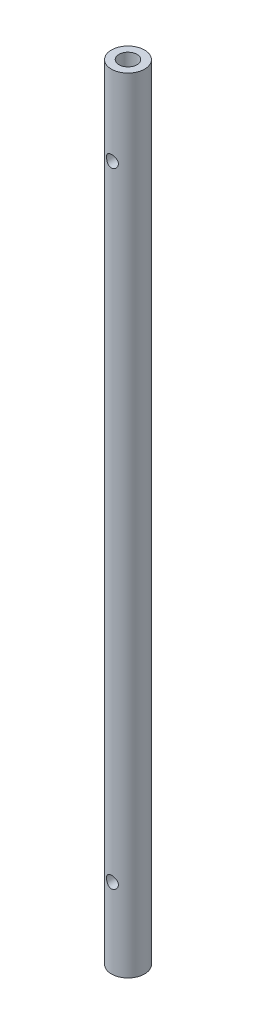
ISO-10303-21;
HEADER;
FILE_DESCRIPTION(('STEP AP214'),'2;1');
FILE_NAME('part.step','',(''),(''),'','','');
FILE_SCHEMA(('AUTOMOTIVE_DESIGN { 1 0 10303 214 1 1 1 1 }'));
ENDSEC;
DATA;
#1=APPLICATION_CONTEXT('core data for automotive mechanical design processes');
#2=APPLICATION_PROTOCOL_DEFINITION('international standard','automotive_design',2000,#1);
#3=PRODUCT_CONTEXT('',#1,'mechanical');
#4=PRODUCT('Part','Part','',(#3));
#5=PRODUCT_RELATED_PRODUCT_CATEGORY('part','',(#4));
#6=PRODUCT_DEFINITION_FORMATION('','',#4);
#7=PRODUCT_DEFINITION_CONTEXT('part definition',#1,'design');
#8=PRODUCT_DEFINITION('design','',#6,#7);
#9=PRODUCT_DEFINITION_SHAPE('','',#8);
#10=(LENGTH_UNIT() NAMED_UNIT(*) SI_UNIT(.MILLI.,.METRE.));
#11=(NAMED_UNIT(*) PLANE_ANGLE_UNIT() SI_UNIT($,.RADIAN.));
#12=(NAMED_UNIT(*) SI_UNIT($,.STERADIAN.) SOLID_ANGLE_UNIT());
#13=UNCERTAINTY_MEASURE_WITH_UNIT(LENGTH_MEASURE(1.E-05),#10,'distance_accuracy_value','');
#14=(GEOMETRIC_REPRESENTATION_CONTEXT(3) GLOBAL_UNCERTAINTY_ASSIGNED_CONTEXT((#13)) GLOBAL_UNIT_ASSIGNED_CONTEXT((#10,
#11,#12)) REPRESENTATION_CONTEXT('',''));
#15=CARTESIAN_POINT('',(0.,0.,0.));
#16=DIRECTION('',(0.,0.,1.));
#17=DIRECTION('',(1.,0.,0.));
#18=AXIS2_PLACEMENT_3D('',#15,#16,#17);
#19=CARTESIAN_POINT('',(0.,134.7724,0.));
#20=DIRECTION('',(0.,1.,0.));
#21=DIRECTION('',(0.,0.,1.));
#22=AXIS2_PLACEMENT_3D('',#19,#20,#21);
#23=CONICAL_SURFACE('',#22,1.7272,1.02974425867665);
#24=CARTESIAN_POINT('',(0.,134.7724,0.));
#25=DIRECTION('',(0.,1.,0.));
#26=DIRECTION('',(0.,0.,1.));
#27=AXIS2_PLACEMENT_3D('',#24,#25,#26);
#28=CIRCLE('',#27,1.7272);
#29=CARTESIAN_POINT('',(-1.11997871854781,134.7724,-1.31486406521738));
#30=VERTEX_POINT('',#29);
#31=CARTESIAN_POINT('',(-1.11997871854781,134.7724,1.31486406521738));
#32=VERTEX_POINT('',#31);
#33=EDGE_CURVE('E87',#30,#32,#28,.T.);
#34=ORIENTED_EDGE('',*,*,#33,.T.);
#35=CARTESIAN_POINT('',(-1.10083924997971,134.876380646118,1.54890731228398));
#36=CARTESIAN_POINT('',(-1.10511758447228,134.858012832155,1.50835814459138));
#37=CARTESIAN_POINT('',(-1.10888402191525,134.83975657298,1.46770662256737));
#38=CARTESIAN_POINT('',(-1.11544882432673,134.803549455213,1.38619229753739));
#39=CARTESIAN_POINT('',(-1.11824723760108,134.785598581425,1.34532950517744));
#40=CARTESIAN_POINT('',(-1.12528101838931,134.732275875879,1.22229557238897));
#41=CARTESIAN_POINT('',(-1.12814346307315,134.697484931141,1.13979036171758));
#42=CARTESIAN_POINT('',(-1.13079732619442,134.629117552434,0.970440108954381));
#43=CARTESIAN_POINT('',(-1.13046377449956,134.595642412668,0.88355184755493));
#44=CARTESIAN_POINT('',(-1.12817589359432,134.54898752196,0.752002666471074));
#45=CARTESIAN_POINT('',(-1.12711587079375,134.534032436263,0.70796225261359));
#46=CARTESIAN_POINT('',(-1.12459554649117,134.505697605106,0.619389773105011));
#47=CARTESIAN_POINT('',(-1.12313508899023,134.492318476508,0.574857522349348));
#48=CARTESIAN_POINT('',(-1.11777548337252,134.44941522858,0.419029107131832));
#49=CARTESIAN_POINT('',(-1.11345348376878,134.42514539767,0.306031376487295));
#50=CARTESIAN_POINT('',(-1.10979086221514,134.405546431952,0.13538961810765));
#51=CARTESIAN_POINT('',(-1.10903520058948,134.401779664163,0.0787717157606772));
#52=CARTESIAN_POINT('',(-1.10873081641357,134.400240594329,-0.0345470847061932));
#53=CARTESIAN_POINT('',(-1.10918191342738,134.40246739612,-0.0912479691515204));
#54=CARTESIAN_POINT('',(-1.11141205212762,134.414121408052,-0.221572406530796));
#55=CARTESIAN_POINT('',(-1.11355885742403,134.425563702272,-0.295002559258893));
#56=CARTESIAN_POINT('',(-1.11838407367354,134.455628431662,-0.440384970862432));
#57=CARTESIAN_POINT('',(-1.12106340494739,134.474263350518,-0.512334429843554));
#58=CARTESIAN_POINT('',(-1.12576435521266,134.516582974443,-0.656062520665535));
#59=CARTESIAN_POINT('',(-1.12777385681054,134.540349093944,-0.72781688608081));
#60=CARTESIAN_POINT('',(-1.13021183567748,134.590963420783,-0.870179154069858));
#61=CARTESIAN_POINT('',(-1.13064145382998,134.617809389612,-0.940787847270475));
#62=CARTESIAN_POINT('',(-1.1291823336618,134.682032091552,-1.10273118271327));
#63=CARTESIAN_POINT('',(-1.12654220488782,134.720113488266,-1.19378121217159));
#64=CARTESIAN_POINT('',(-1.11932742829999,134.778300988472,-1.32864327288224));
#65=CARTESIAN_POINT('',(-1.11642548696807,134.797672206229,-1.37287044412396));
#66=CARTESIAN_POINT('',(-1.10949476672364,134.836778540783,-1.46107381895178));
#67=CARTESIAN_POINT('',(-1.10546600777706,134.856513651125,-1.50505002697057));
#68=CARTESIAN_POINT('',(-1.10083924997971,134.876380646118,-1.54890731228398));
#69=B_SPLINE_CURVE_WITH_KNOTS('',3,(#35,#36,#37,#38,#39,#40,#41,#42,#43,#44,#45,#46,#47,#48,#49,
#50,#51,#52,#53,#54,#55,#56,#57,#58,#59,#60,#61,#62,#63,#64,#65,#66,#67,#68),.UNSPECIFIED.,.F.,
.F.,(4,2,2,2,2,2,2,2,2,2,2,2,2,2,2,2,4),(0.,0.134154521615997,0.268302347757204,
0.536967002414625,0.816178585226729,0.955708698776483,1.09529324704708,1.44052647667523,
1.61046744072474,1.78038299642616,2.00288343568417,2.22577180111875,2.45249743943343,
2.6790593198581,2.97510233572286,3.12020152788532,3.26529814921655),.UNSPECIFIED.);
#70=EDGE_CURVE('E55',#32,#30,#69,.T.);
#71=ORIENTED_EDGE('',*,*,#70,.T.);
#72=EDGE_LOOP('',(#34,#71));
#73=FACE_BOUND('',#72,.T.);
#74=ADVANCED_FACE('F36',(#73),#23,.F.);
#75=CARTESIAN_POINT('',(0.,149.86,0.));
#76=DIRECTION('',(0.,-1.,0.));
#77=DIRECTION('',(0.,0.,-1.));
#78=AXIS2_PLACEMENT_3D('',#75,#76,#77);
#79=CYLINDRICAL_SURFACE('',#78,3.175);
#80=CARTESIAN_POINT('',(0.,16.3703,-3.175));
#81=CARTESIAN_POINT('',(-0.0614285544766779,16.3703012237574,-3.17500087649076));
#82=CARTESIAN_POINT('',(-0.122848391480888,16.3652763210169,-3.17320130070144));
#83=CARTESIAN_POINT('',(-0.243864611742385,16.3453814145643,-3.1662010034201));
#84=CARTESIAN_POINT('',(-0.303461052111788,16.33051171954,-3.16100038856924));
#85=CARTESIAN_POINT('',(-0.419068309151049,16.2915115500278,-3.14775949893737));
#86=CARTESIAN_POINT('',(-0.47508540318598,16.2673978382583,-3.13972436624609));
#87=CARTESIAN_POINT('',(-0.58227804161651,16.2106749598776,-3.12162393487057));
#88=CARTESIAN_POINT('',(-0.633452431498656,16.1780637743668,-3.11155815385673));
#89=CARTESIAN_POINT('',(-0.731495005230033,16.1039449200735,-3.09000790855595));
#90=CARTESIAN_POINT('',(-0.7781496162439,16.0621656831014,-3.07848610582585));
#91=CARTESIAN_POINT('',(-0.863958107942661,15.9714734586916,-3.055516031792));
#92=CARTESIAN_POINT('',(-0.903110009958693,15.9225585953687,-3.04406778065305));
#93=CARTESIAN_POINT('',(-0.974093633832359,15.816974309823,-3.02211785986225));
#94=CARTESIAN_POINT('',(-1.00563502809097,15.7600994816667,-3.01166094904186));
#95=CARTESIAN_POINT('',(-1.0586113470591,15.6414206024001,-2.99345244738711));
#96=CARTESIAN_POINT('',(-1.0800498566148,15.5796183088365,-2.98569989720789));
#97=CARTESIAN_POINT('',(-1.11138819305283,15.4552850551509,-2.9741742173714));
#98=CARTESIAN_POINT('',(-1.12169236541681,15.3928693002161,-2.97026214805179));
#99=CARTESIAN_POINT('',(-1.13173392893205,15.2670815214047,-2.96645158379256));
#100=CARTESIAN_POINT('',(-1.13147514856467,15.2037098523184,-2.96655163468287));
#101=CARTESIAN_POINT('',(-1.12070953557278,15.0813866338982,-2.97063328242024));
#102=CARTESIAN_POINT('',(-1.11074743190182,15.0223790208862,-2.9744085523292));
#103=CARTESIAN_POINT('',(-1.08175290027525,14.9069353575906,-2.98507483987672));
#104=CARTESIAN_POINT('',(-1.06271924100948,14.8504996575404,-2.99196628047622));
#105=CARTESIAN_POINT('',(-1.01579639288465,14.740632376704,-3.00822311818093));
#106=CARTESIAN_POINT('',(-0.987756625641378,14.6872715264627,-3.01763009039321));
#107=CARTESIAN_POINT('',(-0.923722187948489,14.585847739274,-3.03784253722576));
#108=CARTESIAN_POINT('',(-0.887724971743384,14.5377865051773,-3.04864845893998));
#109=CARTESIAN_POINT('',(-0.806247147627669,14.4452887750887,-3.0712342285018));
#110=CARTESIAN_POINT('',(-0.760326653485443,14.4012436445668,-3.08303358094073));
#111=CARTESIAN_POINT('',(-0.661610098844969,14.321369593097,-3.10571393948941));
#112=CARTESIAN_POINT('',(-0.608813181467752,14.285541697647,-3.11659483086973));
#113=CARTESIAN_POINT('',(-0.496923650490421,14.2227435612336,-3.13639217173446));
#114=CARTESIAN_POINT('',(-0.437759573781159,14.1958916372621,-3.14528190725224));
#115=CARTESIAN_POINT('',(-0.315359989841962,14.1526479980796,-3.15989936928577));
#116=CARTESIAN_POINT('',(-0.252126116160289,14.1362521144617,-3.16562835574328));
#117=CARTESIAN_POINT('',(-0.126684885961715,14.1151105107097,-3.17306329879329));
#118=CARTESIAN_POINT('',(-0.064577181688216,14.1098369556619,-3.17495136824996));
#119=CARTESIAN_POINT('',(0.0596565359676973,14.1095683995767,-3.1750467253115));
#120=CARTESIAN_POINT('',(0.121782543364873,14.1145713815626,-3.1732547352019));
#121=CARTESIAN_POINT('',(0.242087689559502,14.1343044474424,-3.16631168752834));
#122=CARTESIAN_POINT('',(0.300329231110412,14.1486990231227,-3.16127656517542));
#123=CARTESIAN_POINT('',(0.413538192846501,14.18637541607,-3.14846933320479));
#124=CARTESIAN_POINT('',(0.468505187040128,14.2096583867378,-3.14069686838655));
#125=CARTESIAN_POINT('',(0.575332725471093,14.2651689023677,-3.12292068057346));
#126=CARTESIAN_POINT('',(0.627062417893484,14.297629600179,-3.11286035066927));
#127=CARTESIAN_POINT('',(0.724505279210263,14.3703060737422,-3.09163517782237));
#128=CARTESIAN_POINT('',(0.770216385550684,14.4105244964678,-3.08046995852104));
#129=CARTESIAN_POINT('',(0.856811848575502,14.500048413641,-3.05754963314883));
#130=CARTESIAN_POINT('',(0.897320261231922,14.5497183751152,-3.0457941243994));
#131=CARTESIAN_POINT('',(0.969488296473177,14.6553941126563,-3.02359841598846));
#132=CARTESIAN_POINT('',(1.00114750732456,14.711400183358,-3.01315827754058));
#133=CARTESIAN_POINT('',(1.0546547707943,14.8283927369081,-2.99485112677041));
#134=CARTESIAN_POINT('',(1.07649405053024,14.8893836158125,-2.98698641696941));
#135=CARTESIAN_POINT('',(1.1094694490286,15.0145296339403,-2.97489781303426));
#136=CARTESIAN_POINT('',(1.1206113170349,15.0786830539654,-2.97067196334806));
#137=CARTESIAN_POINT('',(1.13139068963521,15.2043056560478,-2.96658222044346));
#138=CARTESIAN_POINT('',(1.13166111008653,15.2657132404762,-2.9664783574786));
#139=CARTESIAN_POINT('',(1.12228164306422,15.3876488823544,-2.97003931415379));
#140=CARTESIAN_POINT('',(1.11263251765991,15.4481770070065,-2.97370384428697));
#141=CARTESIAN_POINT('',(1.08416089230555,15.5651270511925,-2.98419839475885));
#142=CARTESIAN_POINT('',(1.06557142470547,15.6216135313144,-2.99094779649679));
#143=CARTESIAN_POINT('',(1.01994372799954,15.730704592324,-3.0068123311106));
#144=CARTESIAN_POINT('',(0.992903472899547,15.7833082385977,-3.01592803119462));
#145=CARTESIAN_POINT('',(0.929616151238461,15.8859094886754,-3.03604854272464));
#146=CARTESIAN_POINT('',(0.892986233526776,15.9356570488483,-3.0471235224069));
#147=CARTESIAN_POINT('',(0.812177154252537,16.0285027074359,-3.06964995874745));
#148=CARTESIAN_POINT('',(0.767995717285478,16.0715987941755,-3.08110152803636));
#149=CARTESIAN_POINT('',(0.670861718733731,16.1519635787991,-3.10373428576573));
#150=CARTESIAN_POINT('',(0.61759551549228,16.188865332174,-3.11487776157142));
#151=CARTESIAN_POINT('',(0.505234578584048,16.2531654882105,-3.13506244460878));
#152=CARTESIAN_POINT('',(0.446140340356566,16.2805646977874,-3.1441038303194));
#153=CARTESIAN_POINT('',(0.32364519702785,16.3249335008255,-3.15906443826106));
#154=CARTESIAN_POINT('',(0.260236860921375,16.3418845651335,-3.16497811106267));
#155=CARTESIAN_POINT('',(0.13121513161262,16.3645650077149,-3.17294468299437));
#156=CARTESIAN_POINT('',(0.0656025945972245,16.3702986930889,-3.17499906395212));
#157=CARTESIAN_POINT('',(0.,16.3703,-3.175));
#158=B_SPLINE_CURVE_WITH_KNOTS('',3,(#80,#81,#82,#83,#84,#85,#86,#87,#88,#89,#90,#91,#92,#93,
#94,#95,#96,#97,#98,#99,#100,#101,#102,#103,#104,#105,#106,#107,#108,#109,#110,#111,#112,#113,
#114,#115,#116,#117,#118,#119,#120,#121,#122,#123,#124,#125,#126,#127,#128,#129,#130,#131,#132,
#133,#134,#135,#136,#137,#138,#139,#140,#141,#142,#143,#144,#145,#146,#147,#148,#149,#150,#151,
#152,#153,#154,#155,#156,#157),.UNSPECIFIED.,.T.,.F.,(4,2,2,2,2,2,2,2,2,2,2,2,2,2,2,2,2,2,2,2,2,
2,2,2,2,2,2,2,2,2,2,2,2,2,2,2,2,2,4),(0.,0.184043941459561,0.368082112412807,0.551788122807088,
0.735537819443369,0.925722644883207,1.11595755842549,1.31258758821648,1.50914779437035,
1.69830149435247,1.88738663727476,2.06643452933682,2.24550673104465,2.42774410221587,
2.61003985955347,2.80329006106038,2.99656436677724,3.19229416831946,3.38794589132551,
3.57408187032769,3.76018131989992,3.93997181359129,4.1197856456926,4.30465683345397,
4.4895912121053,4.68416822385538,4.87875428732972,5.0735138454388,5.26816867279117,
5.4514735700362,5.63476438593105,5.81351722268551,5.99231294661078,6.17977826003503,
6.36730015993203,6.56359488860407,6.75987294468716,6.95649809396633,7.15304773089831),.UNSPECIFIED.);
#159=CARTESIAN_POINT('',(0.,16.3703,-3.175));
#160=VERTEX_POINT('',#159);
#161=EDGE_CURVE('E11',#160,#160,#158,.T.);
#162=ORIENTED_EDGE('',*,*,#161,.T.);
#163=EDGE_LOOP('',(#162));
#164=FACE_BOUND('',#163,.T.);
#165=CARTESIAN_POINT('',(1.1303,15.24,2.96699290696827));
#166=CARTESIAN_POINT('',(1.13030126949561,15.1787110406615,2.96699180092178));
#167=CARTESIAN_POINT('',(1.12529831217773,15.1174308726543,2.96891266523162));
#168=CARTESIAN_POINT('',(1.10549852105486,14.9967032380783,2.976341367105));
#169=CARTESIAN_POINT('',(1.09070115134954,14.9372558719774,2.9818494009399));
#170=CARTESIAN_POINT('',(1.05191211633808,14.8219662475179,2.9957511550193));
#171=CARTESIAN_POINT('',(1.02794056093624,14.7661164139814,3.00413855954278));
#172=CARTESIAN_POINT('',(0.971553767874789,14.6592107503721,3.02284430324832));
#173=CARTESIAN_POINT('',(0.939136285382002,14.6081561997475,3.03316315558203));
#174=CARTESIAN_POINT('',(0.865225378101705,14.5100077931434,3.05508626986901));
#175=CARTESIAN_POINT('',(0.823416737479139,14.4631591093842,3.06672572194972));
#176=CARTESIAN_POINT('',(0.73258094656503,14.376967856637,3.08968323184446));
#177=CARTESIAN_POINT('',(0.683552447130751,14.3376266937074,3.1010012291171));
#178=CARTESIAN_POINT('',(0.577839731348626,14.2664187200041,3.1224537652803));
#179=CARTESIAN_POINT('',(0.520968849300918,14.2348138911978,3.13254217002369));
#180=CARTESIAN_POINT('',(0.402295832054576,14.181719440706,3.14997980235623));
#181=CARTESIAN_POINT('',(0.340495233260629,14.1602266817679,3.15732987935941));
#182=CARTESIAN_POINT('',(0.216291429363961,14.1288129001187,3.16821317131574));
#183=CARTESIAN_POINT('',(0.154007098319549,14.1184707721896,3.17188488321263));
#184=CARTESIAN_POINT('',(0.028485990440722,14.1083073936133,3.1754922345549));
#185=CARTESIAN_POINT('',(-0.0347505016117874,14.1084830573218,3.17542896974461));
#186=CARTESIAN_POINT('',(-0.157380355815445,14.1190947425401,3.17166431166137));
#187=CARTESIAN_POINT('',(-0.216819232200466,14.1290722215322,3.16812551082658));
#188=CARTESIAN_POINT('',(-0.333116055100486,14.1582391229743,3.15801637664471));
#189=CARTESIAN_POINT('',(-0.389973821301094,14.1774291879277,3.15144583185916));
#190=CARTESIAN_POINT('',(-0.500434290449896,14.2247145890065,3.13581701279072));
#191=CARTESIAN_POINT('',(-0.553980350398553,14.2529307133355,3.12672523235359));
#192=CARTESIAN_POINT('',(-0.655704901634495,14.3173640862445,3.10698647045265));
#193=CARTESIAN_POINT('',(-0.703881757104614,14.353583763269,3.09633901729824));
#194=CARTESIAN_POINT('',(-0.796215706775618,14.4352538860666,3.07392952110036));
#195=CARTESIAN_POINT('',(-0.840022503287888,14.4810929538074,3.06213831691244));
#196=CARTESIAN_POINT('',(-0.919450536225369,14.5795526212715,3.03923485845035));
#197=CARTESIAN_POINT('',(-0.955070114455716,14.6321745914046,3.02812274204891));
#198=CARTESIAN_POINT('',(-1.01769271316585,14.7439592701495,3.00766281876103));
#199=CARTESIAN_POINT('',(-1.04452651167638,14.8032238703236,2.99835093480064));
#200=CARTESIAN_POINT('',(-1.08770687791103,14.9258479460289,2.98296002370199));
#201=CARTESIAN_POINT('',(-1.10405859416822,14.9892053943974,2.97687940969726));
#202=CARTESIAN_POINT('',(-1.12505332850273,15.1147849613907,2.96900658684162));
#203=CARTESIAN_POINT('',(-1.13024679297079,15.1769023871962,2.96701300712206));
#204=CARTESIAN_POINT('',(-1.13035235934412,15.3011397141368,2.96697312971029));
#205=CARTESIAN_POINT('',(-1.12526668272106,15.3632596118363,2.9689259791374));
#206=CARTESIAN_POINT('',(-1.10545550475944,15.4830696369474,2.97635611028256));
#207=CARTESIAN_POINT('',(-1.09113471741141,15.5408368993112,2.98168526601896));
#208=CARTESIAN_POINT('',(-1.05375787852425,15.6531295652805,2.99509779472348));
#209=CARTESIAN_POINT('',(-1.03070014678855,15.707654342991,3.00318169742523));
#210=CARTESIAN_POINT('',(-0.97559321940055,15.8140287007789,3.0215413409512));
#211=CARTESIAN_POINT('',(-0.943258091531739,15.8657183161992,3.03188377797999));
#212=CARTESIAN_POINT('',(-0.870827536052566,15.9631351589139,3.0534751542732));
#213=CARTESIAN_POINT('',(-0.83072951959392,16.0088603886049,3.0647243952155));
#214=CARTESIAN_POINT('',(-0.741245393025425,16.0957068263094,3.0876248127599));
#215=CARTESIAN_POINT('',(-0.691464443347565,16.1364258938531,3.09926313882807));
#216=CARTESIAN_POINT('',(-0.585488794794463,16.2089702537958,3.12101743586169));
#217=CARTESIAN_POINT('',(-0.529294210180945,16.2407957046036,3.13113343394066));
#218=CARTESIAN_POINT('',(-0.412253306959745,16.2943930373707,3.14867455762266));
#219=CARTESIAN_POINT('',(-0.351432796366108,16.3162165220238,3.15611345134428));
#220=CARTESIAN_POINT('',(-0.226662836118681,16.3492165707738,3.16751726579442));
#221=CARTESIAN_POINT('',(-0.16271470643116,16.3603975862936,3.17148363891749));
#222=CARTESIAN_POINT('',(-0.0371588940228269,16.3713516268051,3.17537085125336));
#223=CARTESIAN_POINT('',(0.0243929105435863,16.3716985387022,3.17549520012136));
#224=CARTESIAN_POINT('',(0.146637730412363,16.3624223276304,3.1722011158763));
#225=CARTESIAN_POINT('',(0.207330832009701,16.3528002138126,3.16878304135799));
#226=CARTESIAN_POINT('',(0.324899902225857,16.3242533231202,3.1588730580352));
#227=CARTESIAN_POINT('',(0.381828226370771,16.3055204903234,3.15244466988758));
#228=CARTESIAN_POINT('',(0.491747356923695,16.2594682532889,3.13717898355161));
#229=CARTESIAN_POINT('',(0.544737424039252,16.2321472418806,3.12834123452256));
#230=CARTESIAN_POINT('',(0.647587160628672,16.1684464342489,3.10871467602532));
#231=CARTESIAN_POINT('',(0.69723748981861,16.1317486161492,3.0978620760476));
#232=CARTESIAN_POINT('',(0.7898578088236,16.0508552527356,3.07555250387425));
#233=CARTESIAN_POINT('',(0.832825512939462,16.0066571528158,3.06409532667805));
#234=CARTESIAN_POINT('',(0.912898108309839,15.9095772860472,3.04122635424545));
#235=CARTESIAN_POINT('',(0.949639270596972,15.8563881325584,3.0298412400875));
#236=CARTESIAN_POINT('',(1.01365584279662,15.7442298478198,3.00903053343651));
#237=CARTESIAN_POINT('',(1.04093198735494,15.6852611656152,2.99960478888596));
#238=CARTESIAN_POINT('',(1.08510912643682,15.5630236422474,2.9839099977344));
#239=CARTESIAN_POINT('',(1.10199264087853,15.4997477538929,2.97764627271748));
#240=CARTESIAN_POINT('',(1.12458464442987,15.3709771582326,2.96918932171508));
#241=CARTESIAN_POINT('',(1.13029864362041,15.3054835611847,2.96699408871232));
#242=CARTESIAN_POINT('',(1.1303,15.24,2.96699290696827));
#243=B_SPLINE_CURVE_WITH_KNOTS('',3,(#165,#166,#167,#168,#169,#170,#171,#172,#173,#174,#175,
#176,#177,#178,#179,#180,#181,#182,#183,#184,#185,#186,#187,#188,#189,#190,#191,#192,#193,#194,
#195,#196,#197,#198,#199,#200,#201,#202,#203,#204,#205,#206,#207,#208,#209,#210,#211,#212,#213,
#214,#215,#216,#217,#218,#219,#220,#221,#222,#223,#224,#225,#226,#227,#228,#229,#230,#231,#232,
#233,#234,#235,#236,#237,#238,#239,#240,#241,#242),.UNSPECIFIED.,.T.,.F.,(4,2,2,2,2,2,2,2,2,2,2,
2,2,2,2,2,2,2,2,2,2,2,2,2,2,2,2,2,2,2,2,2,2,2,2,2,2,2,4),(0.,0.183623661784848,
0.367257371351086,0.550490838429559,0.733773056690744,0.924501319590959,1.11526526836209,
1.3117975652931,1.50826884814033,1.69702812609223,1.88573202729147,2.06600906280416,
2.24629867301317,2.42910965891793,2.61197618983504,2.80457310610201,2.99720899560137,
3.19336255385328,3.38941969247878,3.57555921531926,3.761658515007,3.94011049494313,
4.11859681030486,4.30331748902536,4.48809987675376,4.68324756844095,4.87839178402888,
5.07251754238689,5.2665620680873,5.45030949868025,5.63403833058547,5.81405386702817,
5.99410311120744,6.18133819670188,6.36863718318313,6.56461137244543,6.76057034738463,
6.95685802501452,7.15304884667686),.UNSPECIFIED.);
#244=CARTESIAN_POINT('',(1.1303,15.24,2.96699290696827));
#245=VERTEX_POINT('',#244);
#246=EDGE_CURVE('E48',#245,#245,#243,.T.);
#247=ORIENTED_EDGE('',*,*,#246,.T.);
#248=EDGE_LOOP('',(#247));
#249=FACE_BOUND('',#248,.T.);
#250=CARTESIAN_POINT('',(0.,135.7503,-3.175));
#251=CARTESIAN_POINT('',(-0.0614285544766787,135.750301223757,-3.17500087649076));
#252=CARTESIAN_POINT('',(-0.122848391480888,135.745276321017,-3.17320130070144));
#253=CARTESIAN_POINT('',(-0.243864611742386,135.725381414564,-3.1662010034201));
#254=CARTESIAN_POINT('',(-0.303461052111791,135.71051171954,-3.16100038856924));
#255=CARTESIAN_POINT('',(-0.419068309151053,135.671511550028,-3.14775949893737));
#256=CARTESIAN_POINT('',(-0.475085403185983,135.647397838258,-3.13972436624609));
#257=CARTESIAN_POINT('',(-0.582278041616511,135.590674959878,-3.12162393487057));
#258=CARTESIAN_POINT('',(-0.633452431498657,135.558063774367,-3.11155815385673));
#259=CARTESIAN_POINT('',(-0.731495005230038,135.483944920074,-3.09000790855595));
#260=CARTESIAN_POINT('',(-0.778149616243909,135.442165683101,-3.07848610582585));
#261=CARTESIAN_POINT('',(-0.863958107942666,135.351473458692,-3.055516031792));
#262=CARTESIAN_POINT('',(-0.903110009958691,135.302558595369,-3.04406778065305));
#263=CARTESIAN_POINT('',(-0.974093633832352,135.196974309823,-3.02211785986226));
#264=CARTESIAN_POINT('',(-1.00563502809097,135.140099481667,-3.01166094904186));
#265=CARTESIAN_POINT('',(-1.0586113470591,135.0214206024,-2.99345244738711));
#266=CARTESIAN_POINT('',(-1.0800498566148,134.959618308836,-2.98569989720789));
#267=CARTESIAN_POINT('',(-1.11138819305283,134.835285055151,-2.9741742173714));
#268=CARTESIAN_POINT('',(-1.12169236541681,134.772869300216,-2.97026214805179));
#269=CARTESIAN_POINT('',(-1.13173392893205,134.647081521405,-2.96645158379256));
#270=CARTESIAN_POINT('',(-1.13147514856467,134.583709852318,-2.96655163468287));
#271=CARTESIAN_POINT('',(-1.12070953557278,134.461386633898,-2.97063328242024));
#272=CARTESIAN_POINT('',(-1.11074743190182,134.402379020886,-2.9744085523292));
#273=CARTESIAN_POINT('',(-1.08175290027524,134.286935357591,-2.98507483987673));
#274=CARTESIAN_POINT('',(-1.06271924100947,134.23049965754,-2.99196628047623));
#275=CARTESIAN_POINT('',(-1.01579639288465,134.120632376704,-3.00822311818093));
#276=CARTESIAN_POINT('',(-0.987756625641377,134.067271526463,-3.01763009039321));
#277=CARTESIAN_POINT('',(-0.923722187948483,133.965847739274,-3.03784253722577));
#278=CARTESIAN_POINT('',(-0.887724971743371,133.917786505177,-3.04864845893998));
#279=CARTESIAN_POINT('',(-0.806247147627661,133.825288775089,-3.0712342285018));
#280=CARTESIAN_POINT('',(-0.760326653485446,133.781243644567,-3.08303358094073));
#281=CARTESIAN_POINT('',(-0.661610098844978,133.701369593097,-3.10571393948941));
#282=CARTESIAN_POINT('',(-0.608813181467755,133.665541697647,-3.11659483086972));
#283=CARTESIAN_POINT('',(-0.496923650490422,133.602743561234,-3.13639217173446));
#284=CARTESIAN_POINT('',(-0.437759573781162,133.575891637262,-3.14528190725224));
#285=CARTESIAN_POINT('',(-0.315359989841969,133.53264799808,-3.15989936928577));
#286=CARTESIAN_POINT('',(-0.252126116160296,133.516252114462,-3.16562835574328));
#287=CARTESIAN_POINT('',(-0.126684885961719,133.49511051071,-3.17306329879329));
#288=CARTESIAN_POINT('',(-0.0645771816882178,133.489836955662,-3.17495136824996));
#289=CARTESIAN_POINT('',(0.0596565359677017,133.489568399577,-3.1750467253115));
#290=CARTESIAN_POINT('',(0.121782543364881,133.494571381563,-3.1732547352019));
#291=CARTESIAN_POINT('',(0.242087689559513,133.514304447442,-3.16631168752833));
#292=CARTESIAN_POINT('',(0.300329231110421,133.528699023123,-3.16127656517542));
#293=CARTESIAN_POINT('',(0.413538192846511,133.56637541607,-3.14846933320479));
#294=CARTESIAN_POINT('',(0.46850518704014,133.589658386738,-3.14069686838655));
#295=CARTESIAN_POINT('',(0.575332725471102,133.645168902368,-3.12292068057346));
#296=CARTESIAN_POINT('',(0.627062417893487,133.677629600179,-3.11286035066926));
#297=CARTESIAN_POINT('',(0.724505279210267,133.750306073742,-3.09163517782237));
#298=CARTESIAN_POINT('',(0.770216385550696,133.790524496468,-3.08046995852104));
#299=CARTESIAN_POINT('',(0.856811848575514,133.880048413641,-3.05754963314883));
#300=CARTESIAN_POINT('',(0.897320261231928,133.929718375115,-3.0457941243994));
#301=CARTESIAN_POINT('',(0.969488296473181,134.035394112656,-3.02359841598846));
#302=CARTESIAN_POINT('',(1.00114750732456,134.091400183358,-3.01315827754058));
#303=CARTESIAN_POINT('',(1.05465477079431,134.208392736908,-2.99485112677041));
#304=CARTESIAN_POINT('',(1.07649405053025,134.269383615813,-2.9869864169694));
#305=CARTESIAN_POINT('',(1.10946944902861,134.39452963394,-2.97489781303425));
#306=CARTESIAN_POINT('',(1.12061131703491,134.458683053965,-2.97067196334806));
#307=CARTESIAN_POINT('',(1.13139068963522,134.584305656048,-2.96658222044346));
#308=CARTESIAN_POINT('',(1.13166111008654,134.645713240476,-2.96647835747859));
#309=CARTESIAN_POINT('',(1.12228164306423,134.767648882354,-2.97003931415378));
#310=CARTESIAN_POINT('',(1.11263251765992,134.828177007007,-2.97370384428697));
#311=CARTESIAN_POINT('',(1.08416089230556,134.945127051193,-2.98419839475885));
#312=CARTESIAN_POINT('',(1.06557142470548,135.001613531314,-2.99094779649679));
#313=CARTESIAN_POINT('',(1.01994372799955,135.110704592324,-3.0068123311106));
#314=CARTESIAN_POINT('',(0.992903472899561,135.163308238598,-3.01592803119462));
#315=CARTESIAN_POINT('',(0.92961615123847,135.265909488675,-3.03604854272463));
#316=CARTESIAN_POINT('',(0.89298623352678,135.315657048848,-3.0471235224069));
#317=CARTESIAN_POINT('',(0.81217715425254,135.408502707436,-3.06964995874745));
#318=CARTESIAN_POINT('',(0.767995717285484,135.451598794176,-3.08110152803636));
#319=CARTESIAN_POINT('',(0.670861718733734,135.531963578799,-3.10373428576573));
#320=CARTESIAN_POINT('',(0.61759551549228,135.568865332174,-3.11487776157142));
#321=CARTESIAN_POINT('',(0.505234578584043,135.633165488211,-3.13506244460878));
#322=CARTESIAN_POINT('',(0.446140340356558,135.660564697787,-3.1441038303194));
#323=CARTESIAN_POINT('',(0.323645197027843,135.704933500825,-3.15906443826106));
#324=CARTESIAN_POINT('',(0.260236860921373,135.721884565133,-3.16497811106267));
#325=CARTESIAN_POINT('',(0.131215131612621,135.744565007715,-3.17294468299437));
#326=CARTESIAN_POINT('',(0.065602594597224,135.750298693089,-3.17499906395212));
#327=CARTESIAN_POINT('',(0.,135.7503,-3.175));
#328=B_SPLINE_CURVE_WITH_KNOTS('',3,(#250,#251,#252,#253,#254,#255,#256,#257,#258,#259,#260,
#261,#262,#263,#264,#265,#266,#267,#268,#269,#270,#271,#272,#273,#274,#275,#276,#277,#278,#279,
#280,#281,#282,#283,#284,#285,#286,#287,#288,#289,#290,#291,#292,#293,#294,#295,#296,#297,#298,
#299,#300,#301,#302,#303,#304,#305,#306,#307,#308,#309,#310,#311,#312,#313,#314,#315,#316,#317,
#318,#319,#320,#321,#322,#323,#324,#325,#326,#327),.UNSPECIFIED.,.T.,.F.,(4,2,2,2,2,2,2,2,2,2,2,
2,2,2,2,2,2,2,2,2,2,2,2,2,2,2,2,2,2,2,2,2,2,2,2,2,2,2,4),(0.,0.184043941459563,
0.368082112412806,0.551788122807094,0.735537819443369,0.925722644883215,1.11595755842549,
1.31258758821646,1.50914779437035,1.69830149435247,1.88738663727475,2.06643452933684,
2.24550673104466,2.42774410221589,2.61003985955347,2.80329006106037,2.99656436677723,
3.19229416831945,3.3879458913255,3.57408187032769,3.76018131989992,3.93997181359131,
4.1197856456926,4.30465683345398,4.48959121210532,4.68416822385536,4.87875428732972,
5.07351384543882,5.26816867279119,5.4514735700362,5.63476438593106,5.81351722268548,
5.99231294661076,6.17977826003502,6.36730015993205,6.56359488860408,6.75987294468718,
6.95649809396635,7.15304773089832),.UNSPECIFIED.);
#329=CARTESIAN_POINT('',(0.,135.7503,-3.175));
#330=VERTEX_POINT('',#329);
#331=EDGE_CURVE('E134',#330,#330,#328,.T.);
#332=ORIENTED_EDGE('',*,*,#331,.T.);
#333=EDGE_LOOP('',(#332));
#334=FACE_BOUND('',#333,.T.);
#335=CARTESIAN_POINT('',(1.1303,134.62,2.96699290696827));
#336=CARTESIAN_POINT('',(1.13030126949561,134.558711040661,2.96699180092177));
#337=CARTESIAN_POINT('',(1.12529831217774,134.497430872654,2.96891266523162));
#338=CARTESIAN_POINT('',(1.10549852105487,134.376703238078,2.976341367105));
#339=CARTESIAN_POINT('',(1.09070115134955,134.317255871977,2.9818494009399));
#340=CARTESIAN_POINT('',(1.05191211633808,134.201966247518,2.99575115501929));
#341=CARTESIAN_POINT('',(1.02794056093624,134.146116413981,3.00413855954278));
#342=CARTESIAN_POINT('',(0.971553767874788,134.039210750372,3.02284430324832));
#343=CARTESIAN_POINT('',(0.939136285382005,133.988156199747,3.03316315558203));
#344=CARTESIAN_POINT('',(0.865225378101715,133.890007793143,3.05508626986901));
#345=CARTESIAN_POINT('',(0.82341673747915,133.843159109384,3.06672572194972));
#346=CARTESIAN_POINT('',(0.732580946565053,133.756967856637,3.08968323184445));
#347=CARTESIAN_POINT('',(0.683552447130785,133.717626693707,3.1010012291171));
#348=CARTESIAN_POINT('',(0.577839731348666,133.646418720004,3.1224537652803));
#349=CARTESIAN_POINT('',(0.520968849300954,133.614813891198,3.13254217002368));
#350=CARTESIAN_POINT('',(0.402295832054604,133.561719440706,3.14997980235623));
#351=CARTESIAN_POINT('',(0.340495233260654,133.540226681768,3.15732987935941));
#352=CARTESIAN_POINT('',(0.216291429363981,133.508812900119,3.16821317131574));
#353=CARTESIAN_POINT('',(0.154007098319568,133.49847077219,3.17188488321263));
#354=CARTESIAN_POINT('',(0.0284859904407413,133.488307393613,3.1754922345549));
#355=CARTESIAN_POINT('',(-0.0347505016117677,133.488483057322,3.17542896974461));
#356=CARTESIAN_POINT('',(-0.157380355815426,133.49909474254,3.17166431166137));
#357=CARTESIAN_POINT('',(-0.216819232200448,133.509072221532,3.16812551082658));
#358=CARTESIAN_POINT('',(-0.33311605510047,133.538239122974,3.15801637664471));
#359=CARTESIAN_POINT('',(-0.389973821301079,133.557429187928,3.15144583185917));
#360=CARTESIAN_POINT('',(-0.500434290449881,133.604714589007,3.13581701279072));
#361=CARTESIAN_POINT('',(-0.553980350398538,133.632930713335,3.1267252323536));
#362=CARTESIAN_POINT('',(-0.655704901634482,133.697364086244,3.10698647045265));
#363=CARTESIAN_POINT('',(-0.703881757104602,133.733583763269,3.09633901729824));
#364=CARTESIAN_POINT('',(-0.796215706775607,133.815253886067,3.07392952110036));
#365=CARTESIAN_POINT('',(-0.840022503287876,133.861092953807,3.06213831691245));
#366=CARTESIAN_POINT('',(-0.919450536225356,133.959552621272,3.03923485845036));
#367=CARTESIAN_POINT('',(-0.955070114455706,134.012174591405,3.02812274204891));
#368=CARTESIAN_POINT('',(-1.01769271316584,134.123959270149,3.00766281876103));
#369=CARTESIAN_POINT('',(-1.04452651167637,134.183223870324,2.99835093480064));
#370=CARTESIAN_POINT('',(-1.08770687791103,134.305847946029,2.98296002370199));
#371=CARTESIAN_POINT('',(-1.10405859416822,134.369205394397,2.97687940969726));
#372=CARTESIAN_POINT('',(-1.12505332850273,134.494784961391,2.96900658684162));
#373=CARTESIAN_POINT('',(-1.13024679297079,134.556902387196,2.96701300712206));
#374=CARTESIAN_POINT('',(-1.13035235934412,134.681139714137,2.96697312971029));
#375=CARTESIAN_POINT('',(-1.12526668272106,134.743259611836,2.9689259791374));
#376=CARTESIAN_POINT('',(-1.10545550475944,134.863069636947,2.97635611028255));
#377=CARTESIAN_POINT('',(-1.09113471741141,134.920836899311,2.98168526601896));
#378=CARTESIAN_POINT('',(-1.05375787852425,135.033129565281,2.99509779472348));
#379=CARTESIAN_POINT('',(-1.03070014678855,135.087654342991,3.00318169742523));
#380=CARTESIAN_POINT('',(-0.975593219400552,135.194028700779,3.0215413409512));
#381=CARTESIAN_POINT('',(-0.943258091531741,135.245718316199,3.03188377797999));
#382=CARTESIAN_POINT('',(-0.870827536052561,135.343135158914,3.0534751542732));
#383=CARTESIAN_POINT('',(-0.83072951959391,135.388860388605,3.06472439521551));
#384=CARTESIAN_POINT('',(-0.741245393025423,135.475706826309,3.0876248127599));
#385=CARTESIAN_POINT('',(-0.691464443347576,135.516425893853,3.09926313882806));
#386=CARTESIAN_POINT('',(-0.585488794794489,135.588970253796,3.12101743586169));
#387=CARTESIAN_POINT('',(-0.52929421018097,135.620795704604,3.13113343394065));
#388=CARTESIAN_POINT('',(-0.412253306959771,135.674393037371,3.14867455762266));
#389=CARTESIAN_POINT('',(-0.351432796366135,135.696216522024,3.15611345134428));
#390=CARTESIAN_POINT('',(-0.226662836118703,135.729216570774,3.16751726579441));
#391=CARTESIAN_POINT('',(-0.162714706431175,135.740397586294,3.17148363891749));
#392=CARTESIAN_POINT('',(-0.0371588940228375,135.751351626805,3.17537085125336));
#393=CARTESIAN_POINT('',(0.0243929105435748,135.751698538702,3.17549520012136));
#394=CARTESIAN_POINT('',(0.146637730412351,135.74242232763,3.1722011158763));
#395=CARTESIAN_POINT('',(0.207330832009689,135.732800213813,3.16878304135799));
#396=CARTESIAN_POINT('',(0.324899902225846,135.70425332312,3.1588730580352));
#397=CARTESIAN_POINT('',(0.38182822637076,135.685520490323,3.15244466988759));
#398=CARTESIAN_POINT('',(0.491747356923683,135.639468253289,3.13717898355162));
#399=CARTESIAN_POINT('',(0.544737424039239,135.612147241881,3.12834123452256));
#400=CARTESIAN_POINT('',(0.647587160628663,135.548446434249,3.10871467602532));
#401=CARTESIAN_POINT('',(0.697237489818607,135.511748616149,3.0978620760476));
#402=CARTESIAN_POINT('',(0.789857808823598,135.430855252736,3.07555250387425));
#403=CARTESIAN_POINT('',(0.832825512939458,135.386657152816,3.06409532667805));
#404=CARTESIAN_POINT('',(0.912898108309828,135.289577286047,3.04122635424545));
#405=CARTESIAN_POINT('',(0.949639270596959,135.236388132558,3.0298412400875));
#406=CARTESIAN_POINT('',(1.0136558427966,135.12422984782,3.00903053343652));
#407=CARTESIAN_POINT('',(1.04093198735493,135.065261165615,2.99960478888596));
#408=CARTESIAN_POINT('',(1.08510912643682,134.943023642247,2.9839099977344));
#409=CARTESIAN_POINT('',(1.10199264087853,134.879747753893,2.97764627271748));
#410=CARTESIAN_POINT('',(1.12458464442988,134.750977158233,2.96918932171508));
#411=CARTESIAN_POINT('',(1.13029864362042,134.685483561185,2.96699408871232));
#412=CARTESIAN_POINT('',(1.1303,134.62,2.96699290696827));
#413=B_SPLINE_CURVE_WITH_KNOTS('',3,(#335,#336,#337,#338,#339,#340,#341,#342,#343,#344,#345,
#346,#347,#348,#349,#350,#351,#352,#353,#354,#355,#356,#357,#358,#359,#360,#361,#362,#363,#364,
#365,#366,#367,#368,#369,#370,#371,#372,#373,#374,#375,#376,#377,#378,#379,#380,#381,#382,#383,
#384,#385,#386,#387,#388,#389,#390,#391,#392,#393,#394,#395,#396,#397,#398,#399,#400,#401,#402,
#403,#404,#405,#406,#407,#408,#409,#410,#411,#412),.UNSPECIFIED.,.T.,.F.,(4,2,2,2,2,2,2,2,2,2,2,
2,2,2,2,2,2,2,2,2,2,2,2,2,2,2,2,2,2,2,2,2,2,2,2,2,2,2,4),(0.,0.183623661784836,
0.367257371351078,0.550490838429582,0.73377305669074,0.924501319590929,1.11526526836205,
1.31179756529307,1.50826884814031,1.69702812609222,1.88573202729145,2.06600906280414,
2.24629867301315,2.42910965891791,2.61197618983503,2.80457310610201,2.99720899560135,
3.19336255385327,3.38941969247877,3.57555921531924,3.76165851500698,3.94011049494314,
4.11859681030486,4.3033174890254,4.48809987675377,4.68324756844094,4.87839178402885,
5.07251754238687,5.2665620680873,5.45030949868024,5.63403833058546,5.81405386702816,
5.99410311120744,6.18133819670187,6.36863718318312,6.5646113724454,6.7605703473846,
6.95685802501452,7.15304884667687),.UNSPECIFIED.);
#414=CARTESIAN_POINT('',(1.1303,134.62,2.96699290696827));
#415=VERTEX_POINT('',#414);
#416=EDGE_CURVE('E130',#415,#415,#413,.T.);
#417=ORIENTED_EDGE('',*,*,#416,.T.);
#418=EDGE_LOOP('',(#417));
#419=FACE_BOUND('',#418,.T.);
#420=CARTESIAN_POINT('',(0.,149.86,0.));
#421=DIRECTION('',(0.,1.,0.));
#422=DIRECTION('',(0.,0.,1.));
#423=AXIS2_PLACEMENT_3D('',#420,#421,#422);
#424=CIRCLE('',#423,3.175);
#425=CARTESIAN_POINT('',(0.,149.86,3.175));
#426=VERTEX_POINT('',#425);
#427=EDGE_CURVE('E77',#426,#426,#424,.T.);
#428=ORIENTED_EDGE('',*,*,#427,.F.);
#429=EDGE_LOOP('',(#428));
#430=FACE_BOUND('',#429,.T.);
#431=CARTESIAN_POINT('',(0.,0.,0.));
#432=DIRECTION('',(0.,1.,0.));
#433=DIRECTION('',(0.,0.,1.));
#434=AXIS2_PLACEMENT_3D('',#431,#432,#433);
#435=CIRCLE('',#434,3.175);
#436=CARTESIAN_POINT('',(0.,0.,3.175));
#437=VERTEX_POINT('',#436);
#438=EDGE_CURVE('E98',#437,#437,#435,.T.);
#439=ORIENTED_EDGE('',*,*,#438,.T.);
#440=EDGE_LOOP('',(#439));
#441=FACE_BOUND('',#440,.T.);
#442=ADVANCED_FACE('F38',(#164,#249,#334,#419,#430,#441),#79,.T.);
#443=CARTESIAN_POINT('',(0.,149.86,0.));
#444=DIRECTION('',(0.,1.,0.));
#445=DIRECTION('',(0.,0.,1.));
#446=AXIS2_PLACEMENT_3D('',#443,#444,#445);
#447=PLANE('',#446);
#448=CARTESIAN_POINT('',(0.,149.86,0.));
#449=DIRECTION('',(0.,1.,0.));
#450=DIRECTION('',(0.,0.,1.));
#451=AXIS2_PLACEMENT_3D('',#448,#449,#450);
#452=CIRCLE('',#451,1.72719999999999);
#453=CARTESIAN_POINT('',(0.,149.86,1.72719999999999));
#454=VERTEX_POINT('',#453);
#455=EDGE_CURVE('E92',#454,#454,#452,.T.);
#456=ORIENTED_EDGE('',*,*,#455,.F.);
#457=EDGE_LOOP('',(#456));
#458=FACE_BOUND('',#457,.T.);
#459=ORIENTED_EDGE('',*,*,#427,.T.);
#460=EDGE_LOOP('',(#459));
#461=FACE_BOUND('',#460,.T.);
#462=ADVANCED_FACE('F143',(#458,#461),#447,.T.);
#463=CARTESIAN_POINT('',(0.,0.,0.));
#464=DIRECTION('',(0.,1.,0.));
#465=DIRECTION('',(0.,0.,1.));
#466=AXIS2_PLACEMENT_3D('',#463,#464,#465);
#467=PLANE('',#466);
#468=CARTESIAN_POINT('',(0.,0.,0.));
#469=DIRECTION('',(0.,-1.,0.));
#470=DIRECTION('',(0.,0.,-1.));
#471=AXIS2_PLACEMENT_3D('',#468,#469,#470);
#472=CIRCLE('',#471,1.7272);
#473=CARTESIAN_POINT('',(0.,0.,-1.7272));
#474=VERTEX_POINT('',#473);
#475=EDGE_CURVE('E86',#474,#474,#472,.T.);
#476=ORIENTED_EDGE('',*,*,#475,.F.);
#477=EDGE_LOOP('',(#476));
#478=FACE_BOUND('',#477,.T.);
#479=ORIENTED_EDGE('',*,*,#438,.F.);
#480=EDGE_LOOP('',(#479));
#481=FACE_BOUND('',#480,.T.);
#482=ADVANCED_FACE('F146',(#478,#481),#467,.F.);
#483=CARTESIAN_POINT('',(0.,12.7,0.));
#484=DIRECTION('',(0.,-1.,0.));
#485=DIRECTION('',(0.,0.,-1.));
#486=AXIS2_PLACEMENT_3D('',#483,#484,#485);
#487=CONICAL_SURFACE('',#486,1.7272,1.02974425867665);
#488=CARTESIAN_POINT('',(0.,13.7378064611844,0.));
#489=VERTEX_POINT('',#488);
#490=VERTEX_LOOP('',#489);
#491=FACE_BOUND('',#490,.T.);
#492=CARTESIAN_POINT('',(0.,12.7,0.));
#493=DIRECTION('',(0.,-1.,0.));
#494=DIRECTION('',(0.,0.,-1.));
#495=AXIS2_PLACEMENT_3D('',#492,#493,#494);
#496=CIRCLE('',#495,1.7272);
#497=CARTESIAN_POINT('',(0.,12.7,-1.7272));
#498=VERTEX_POINT('',#497);
#499=EDGE_CURVE('E90',#498,#498,#496,.T.);
#500=ORIENTED_EDGE('',*,*,#499,.T.);
#501=EDGE_LOOP('',(#500));
#502=FACE_BOUND('',#501,.T.);
#503=ADVANCED_FACE('F156',(#491,#502),#487,.F.);
#504=CARTESIAN_POINT('',(0.,0.,0.));
#505=DIRECTION('',(0.,-1.,0.));
#506=DIRECTION('',(0.,0.,-1.));
#507=AXIS2_PLACEMENT_3D('',#504,#505,#506);
#508=CYLINDRICAL_SURFACE('',#507,1.7272);
#509=ORIENTED_EDGE('',*,*,#499,.F.);
#510=EDGE_LOOP('',(#509));
#511=FACE_BOUND('',#510,.T.);
#512=ORIENTED_EDGE('',*,*,#475,.T.);
#513=EDGE_LOOP('',(#512));
#514=FACE_BOUND('',#513,.T.);
#515=ADVANCED_FACE('F161',(#511,#514),#508,.F.);
#516=CARTESIAN_POINT('',(1.11997871854782,134.7724,1.31486406521738));
#517=VERTEX_POINT('',#516);
#518=CARTESIAN_POINT('',(1.11997871854782,134.7724,-1.31486406521738));
#519=VERTEX_POINT('',#518);
#520=EDGE_CURVE('E82',#517,#519,#28,.T.);
#521=ORIENTED_EDGE('',*,*,#520,.T.);
#522=CARTESIAN_POINT('',(1.10083924997972,134.876380646118,-1.54890731228398));
#523=CARTESIAN_POINT('',(1.10511758447229,134.858012832155,-1.50835814459138));
#524=CARTESIAN_POINT('',(1.10888402191526,134.83975657298,-1.46770662256736));
#525=CARTESIAN_POINT('',(1.11544882432674,134.803549455213,-1.38619229753738));
#526=CARTESIAN_POINT('',(1.11824723760109,134.785598581425,-1.34532950517743));
#527=CARTESIAN_POINT('',(1.12528101838931,134.732275875879,-1.22229557238896));
#528=CARTESIAN_POINT('',(1.12814346307316,134.697484931141,-1.13979036171757));
#529=CARTESIAN_POINT('',(1.13079732619442,134.629117552434,-0.970440108954373));
#530=CARTESIAN_POINT('',(1.13046377449956,134.595642412668,-0.883551847554921));
#531=CARTESIAN_POINT('',(1.12817589359432,134.54898752196,-0.752002666471064));
#532=CARTESIAN_POINT('',(1.12711587079376,134.534032436263,-0.70796225261358));
#533=CARTESIAN_POINT('',(1.12459554649117,134.505697605106,-0.619389773104999));
#534=CARTESIAN_POINT('',(1.12313508899023,134.492318476508,-0.574857522349335));
#535=CARTESIAN_POINT('',(1.11777548337252,134.44941522858,-0.419029107131818));
#536=CARTESIAN_POINT('',(1.11345348376878,134.42514539767,-0.306031376487281));
#537=CARTESIAN_POINT('',(1.10979086221514,134.405546431952,-0.135389618107633));
#538=CARTESIAN_POINT('',(1.10903520058949,134.401779664163,-0.0787717157606592));
#539=CARTESIAN_POINT('',(1.10873081641357,134.400240594329,0.0345470847062143));
#540=CARTESIAN_POINT('',(1.10918191342738,134.40246739612,0.0912479691515429));
#541=CARTESIAN_POINT('',(1.11141205212763,134.414121408052,0.221572406530823));
#542=CARTESIAN_POINT('',(1.11355885742404,134.425563702272,0.295002559258922));
#543=CARTESIAN_POINT('',(1.11838407367354,134.455628431662,0.440384970862465));
#544=CARTESIAN_POINT('',(1.1210634049474,134.474263350518,0.51233442984359));
#545=CARTESIAN_POINT('',(1.12576435521266,134.516582974443,0.656062520665572));
#546=CARTESIAN_POINT('',(1.12777385681055,134.540349093944,0.727816886080846));
#547=CARTESIAN_POINT('',(1.13021183567748,134.590963420783,0.870179154069899));
#548=CARTESIAN_POINT('',(1.13064145382998,134.617809389612,0.940787847270521));
#549=CARTESIAN_POINT('',(1.1291823336618,134.682032091552,1.10273118271331));
#550=CARTESIAN_POINT('',(1.12654220488782,134.720113488266,1.19378121217162));
#551=CARTESIAN_POINT('',(1.11932742829999,134.778300988472,1.32864327288225));
#552=CARTESIAN_POINT('',(1.11642548696808,134.797672206229,1.37287044412396));
#553=CARTESIAN_POINT('',(1.10949476672364,134.836778540783,1.46107381895178));
#554=CARTESIAN_POINT('',(1.10546600777706,134.856513651125,1.50505002697057));
#555=CARTESIAN_POINT('',(1.10083924997972,134.876380646118,1.54890731228398));
#556=B_SPLINE_CURVE_WITH_KNOTS('',3,(#522,#523,#524,#525,#526,#527,#528,#529,#530,#531,#532,
#533,#534,#535,#536,#537,#538,#539,#540,#541,#542,#543,#544,#545,#546,#547,#548,#549,#550,#551,
#552,#553,#554,#555),.UNSPECIFIED.,.F.,.F.,(4,2,2,2,2,2,2,2,2,2,2,2,2,2,2,2,4),(0.,
0.134154521615998,0.268302347757205,0.53696700241463,0.816178585226736,0.955708698776491,
1.0952932470471,1.44052647667524,1.61046744072476,1.78038299642618,2.0028834356842,
2.22577180111878,2.45249743943347,2.67905931985814,2.97510233572286,3.12020152788531,
3.26529814921654),.UNSPECIFIED.);
#557=EDGE_CURVE('E70',#519,#517,#556,.T.);
#558=ORIENTED_EDGE('',*,*,#557,.T.);
#559=EDGE_LOOP('',(#521,#558));
#560=FACE_BOUND('',#559,.T.);
#561=ADVANCED_FACE('F81',(#560),#23,.F.);
#562=CARTESIAN_POINT('',(0.,149.86,0.));
#563=DIRECTION('',(0.,1.,0.));
#564=DIRECTION('',(0.,0.,1.));
#565=AXIS2_PLACEMENT_3D('',#562,#563,#564);
#566=CYLINDRICAL_SURFACE('',#565,1.72719999999999);
#567=ORIENTED_EDGE('',*,*,#33,.F.);
#568=CARTESIAN_POINT('',(-1.11997871854781,134.7724,-1.31486406521738));
#569=CARTESIAN_POINT('',(-1.1117563118953,134.832976825887,-1.32181581233981));
#570=CARTESIAN_POINT('',(-1.09869749231885,134.892066852147,-1.33287491736011));
#571=CARTESIAN_POINT('',(-1.06406784835403,135.005777321766,-1.36069614349703));
#572=CARTESIAN_POINT('',(-1.04256712663722,135.060430212016,-1.37741114322164));
#573=CARTESIAN_POINT('',(-0.992203068229562,135.164467026782,-1.41410990931648));
#574=CARTESIAN_POINT('',(-0.963385983346177,135.213881383834,-1.43407286835776));
#575=CARTESIAN_POINT('',(-0.898898388925019,135.307605754105,-1.47535599515172));
#576=CARTESIAN_POINT('',(-0.863207571163382,135.351900003659,-1.49668005621676));
#577=CARTESIAN_POINT('',(-0.779218972931416,135.441429028962,-1.54229415904368));
#578=CARTESIAN_POINT('',(-0.729817164852483,135.48567356097,-1.5665108787005));
#579=CARTESIAN_POINT('',(-0.623169932381237,135.565331219014,-1.6119015081494));
#580=CARTESIAN_POINT('',(-0.565936419777236,135.60075753093,-1.63307994075352));
#581=CARTESIAN_POINT('',(-0.455943946966899,135.655732100971,-1.66673468239128));
#582=CARTESIAN_POINT('',(-0.404319811384624,135.677005961477,-1.68009624822949));
#583=CARTESIAN_POINT('',(-0.297599296845348,135.711859305066,-1.70223858670538));
#584=CARTESIAN_POINT('',(-0.242505315484777,135.72544403775,-1.71102248433156));
#585=CARTESIAN_POINT('',(-0.130069106636736,135.744242195815,-1.72322673414276));
#586=CARTESIAN_POINT('',(-0.0727185291645659,135.749420794877,-1.726624771535));
#587=CARTESIAN_POINT('',(0.0421538455823042,135.750972569212,-1.72764000703854));
#588=CARTESIAN_POINT('',(0.0996756260260186,135.74734658325,-1.72525775580686));
#589=CARTESIAN_POINT('',(0.209067683286495,135.732074078953,-1.71531944846938));
#590=CARTESIAN_POINT('',(0.261053878103776,135.72099888994,-1.70813214607682));
#591=CARTESIAN_POINT('',(0.362265008867263,135.691968188924,-1.68956603444459));
#592=CARTESIAN_POINT('',(0.411489493592521,135.67401155633,-1.6781865425504));
#593=CARTESIAN_POINT('',(0.509087077601778,135.630658153422,-1.65129194205319));
#594=CARTESIAN_POINT('',(0.557232101701945,135.604879787769,-1.63556975121997));
#595=CARTESIAN_POINT('',(0.64868281200612,135.547208490861,-1.60150432671663));
#596=CARTESIAN_POINT('',(0.691985634309315,135.515311971012,-1.5831595563926));
#597=CARTESIAN_POINT('',(0.779578852931176,135.440752902958,-1.54212835827522));
#598=CARTESIAN_POINT('',(0.822992786323022,135.397188724353,-1.51920854739761));
#599=CARTESIAN_POINT('',(0.902290811982526,135.303533312425,-1.47349522484507));
#600=CARTESIAN_POINT('',(0.938167862848369,135.253436045687,-1.45070185047618));
#601=CARTESIAN_POINT('',(0.998470953574418,135.152660417973,-1.40977449087866));
#602=CARTESIAN_POINT('',(1.02368831392283,135.102553703788,-1.39140241343438));
#603=CARTESIAN_POINT('',(1.06666258077774,134.998112124208,-1.3587452945339));
#604=CARTESIAN_POINT('',(1.08444659178553,134.943793491626,-1.34444546618576));
#605=CARTESIAN_POINT('',(1.10733221724385,134.850055896558,-1.32557963914721));
#606=CARTESIAN_POINT('',(1.11467521161713,134.811497365765,-1.31936135380913));
#607=CARTESIAN_POINT('',(1.11997871854782,134.7724,-1.31486406521738));
#608=B_SPLINE_CURVE_WITH_KNOTS('',3,(#568,#569,#570,#571,#572,#573,#574,#575,#576,#577,#578,
#579,#580,#581,#582,#583,#584,#585,#586,#587,#588,#589,#590,#591,#592,#593,#594,#595,#596,#597,
#598,#599,#600,#601,#602,#603,#604,#605,#606,#607),.UNSPECIFIED.,.F.,.F.,(4,2,2,2,2,2,2,2,2,2,2,
2,2,2,2,2,2,2,2,4),(0.,0.18373839911108,0.36598222738691,0.547101468747043,0.728764265845791,
0.939586230058868,1.15009103252715,1.32160459172635,1.49300091169062,1.665105524858,
1.83719374318754,1.99739476226032,2.15762187994458,2.32745750046521,2.49739304414388,
2.69352038746614,2.88983015758712,3.06627755611706,3.24207583353967,3.36103892274465),.UNSPECIFIED.);
#609=EDGE_CURVE('E76',#30,#519,#608,.T.);
#610=ORIENTED_EDGE('',*,*,#609,.T.);
#611=ORIENTED_EDGE('',*,*,#520,.F.);
#612=CARTESIAN_POINT('',(1.11997871854782,134.7724,1.31486406521738));
#613=CARTESIAN_POINT('',(1.1117563118953,134.832976825887,1.3218158123398));
#614=CARTESIAN_POINT('',(1.09869749231886,134.892066852147,1.3328749173601));
#615=CARTESIAN_POINT('',(1.06406784835404,135.005777321766,1.36069614349703));
#616=CARTESIAN_POINT('',(1.04256712663722,135.060430212016,1.37741114322163));
#617=CARTESIAN_POINT('',(0.992203068229566,135.164467026782,1.41410990931648));
#618=CARTESIAN_POINT('',(0.963385983346181,135.213881383834,1.43407286835775));
#619=CARTESIAN_POINT('',(0.898898388925023,135.307605754105,1.47535599515172));
#620=CARTESIAN_POINT('',(0.863207571163386,135.351900003659,1.49668005621675));
#621=CARTESIAN_POINT('',(0.77921897293142,135.441429028962,1.54229415904367));
#622=CARTESIAN_POINT('',(0.729817164852487,135.48567356097,1.5665108787005));
#623=CARTESIAN_POINT('',(0.623169932381241,135.565331219014,1.61190150814939));
#624=CARTESIAN_POINT('',(0.56593641977724,135.60075753093,1.63307994075352));
#625=CARTESIAN_POINT('',(0.455943946966904,135.655732100971,1.66673468239128));
#626=CARTESIAN_POINT('',(0.40431981138463,135.677005961477,1.68009624822948));
#627=CARTESIAN_POINT('',(0.297599296845356,135.711859305066,1.70223858670538));
#628=CARTESIAN_POINT('',(0.242505315484786,135.72544403775,1.71102248433156));
#629=CARTESIAN_POINT('',(0.130069106636749,135.744242195815,1.72322673414276));
#630=CARTESIAN_POINT('',(0.0727185291645806,135.749420794877,1.726624771535));
#631=CARTESIAN_POINT('',(-0.0421538455822857,135.750972569212,1.72764000703854));
#632=CARTESIAN_POINT('',(-0.0996756260259982,135.74734658325,1.72525775580686));
#633=CARTESIAN_POINT('',(-0.209067683286474,135.732074078953,1.71531944846938));
#634=CARTESIAN_POINT('',(-0.261053878103756,135.72099888994,1.70813214607683));
#635=CARTESIAN_POINT('',(-0.362265008867245,135.691968188924,1.6895660344446));
#636=CARTESIAN_POINT('',(-0.411489493592504,135.67401155633,1.6781865425504));
#637=CARTESIAN_POINT('',(-0.509087077601762,135.630658153422,1.65129194205319));
#638=CARTESIAN_POINT('',(-0.557232101701927,135.604879787769,1.63556975121998));
#639=CARTESIAN_POINT('',(-0.648682812006103,135.547208490861,1.60150432671664));
#640=CARTESIAN_POINT('',(-0.691985634309299,135.515311971012,1.5831595563926));
#641=CARTESIAN_POINT('',(-0.779578852931158,135.440752902958,1.54212835827523));
#642=CARTESIAN_POINT('',(-0.822992786322999,135.397188724353,1.51920854739763));
#643=CARTESIAN_POINT('',(-0.902290811982501,135.303533312425,1.47349522484509));
#644=CARTESIAN_POINT('',(-0.938167862848348,135.253436045687,1.45070185047619));
#645=CARTESIAN_POINT('',(-0.998470953574396,135.152660417973,1.40977449087868));
#646=CARTESIAN_POINT('',(-1.02368831392281,135.102553703788,1.3914024134344));
#647=CARTESIAN_POINT('',(-1.06666258077771,134.998112124208,1.35874529453392));
#648=CARTESIAN_POINT('',(-1.08444659178551,134.943793491626,1.34444546618577));
#649=CARTESIAN_POINT('',(-1.10733221724384,134.850055896558,1.32557963914722));
#650=CARTESIAN_POINT('',(-1.11467521161713,134.811497365765,1.31936135380913));
#651=CARTESIAN_POINT('',(-1.11997871854781,134.7724,1.31486406521738));
#652=B_SPLINE_CURVE_WITH_KNOTS('',3,(#612,#613,#614,#615,#616,#617,#618,#619,#620,#621,#622,
#623,#624,#625,#626,#627,#628,#629,#630,#631,#632,#633,#634,#635,#636,#637,#638,#639,#640,#641,
#642,#643,#644,#645,#646,#647,#648,#649,#650,#651),.UNSPECIFIED.,.F.,.F.,(4,2,2,2,2,2,2,2,2,2,2,
2,2,2,2,2,2,2,2,4),(0.,0.18373839911108,0.365982227386911,0.547101468747044,0.728764265845791,
0.939586230058869,1.15009103252715,1.32160459172635,1.49300091169062,1.66510552485798,
1.83719374318753,1.99739476226031,2.15762187994457,2.3274575004652,2.49739304414385,
2.6935203874661,2.88983015758709,3.066277556117,3.24207583353961,3.36103892274465),.UNSPECIFIED.);
#653=EDGE_CURVE('E66',#517,#32,#652,.T.);
#654=ORIENTED_EDGE('',*,*,#653,.T.);
#655=EDGE_LOOP('',(#567,#610,#611,#654));
#656=FACE_BOUND('',#655,.T.);
#657=ORIENTED_EDGE('',*,*,#455,.T.);
#658=EDGE_LOOP('',(#657));
#659=FACE_BOUND('',#658,.T.);
#660=ADVANCED_FACE('F84',(#656,#659),#566,.F.);
#661=CARTESIAN_POINT('',(0.,134.62,-3.175));
#662=DIRECTION('',(0.,0.,1.));
#663=DIRECTION('',(1.,0.,0.));
#664=AXIS2_PLACEMENT_3D('',#661,#662,#663);
#665=CYLINDRICAL_SURFACE('',#664,1.1303);
#666=ORIENTED_EDGE('',*,*,#70,.F.);
#667=ORIENTED_EDGE('',*,*,#653,.F.);
#668=ORIENTED_EDGE('',*,*,#557,.F.);
#669=ORIENTED_EDGE('',*,*,#609,.F.);
#670=EDGE_LOOP('',(#666,#667,#668,#669));
#671=FACE_BOUND('',#670,.T.);
#672=ORIENTED_EDGE('',*,*,#416,.F.);
#673=EDGE_LOOP('',(#672));
#674=FACE_BOUND('',#673,.T.);
#675=ORIENTED_EDGE('',*,*,#331,.F.);
#676=EDGE_LOOP('',(#675));
#677=FACE_BOUND('',#676,.T.);
#678=ADVANCED_FACE('F68',(#671,#674,#677),#665,.F.);
#679=CARTESIAN_POINT('',(0.,15.24,-3.175));
#680=DIRECTION('',(0.,0.,1.));
#681=DIRECTION('',(1.,0.,0.));
#682=AXIS2_PLACEMENT_3D('',#679,#680,#681);
#683=CYLINDRICAL_SURFACE('',#682,1.1303);
#684=ORIENTED_EDGE('',*,*,#246,.F.);
#685=EDGE_LOOP('',(#684));
#686=FACE_BOUND('',#685,.T.);
#687=ORIENTED_EDGE('',*,*,#161,.F.);
#688=EDGE_LOOP('',(#687));
#689=FACE_BOUND('',#688,.T.);
#690=ADVANCED_FACE('F115',(#686,#689),#683,.F.);
#691=CLOSED_SHELL('',(#74,#442,#462,#482,#503,#515,#561,#660,#678,#690));
#692=MANIFOLD_SOLID_BREP('B2',#691);
#693=ADVANCED_BREP_SHAPE_REPRESENTATION('',(#18,#692),#14);
#694=SHAPE_DEFINITION_REPRESENTATION(#9,#693);
ENDSEC;
END-ISO-10303-21;
